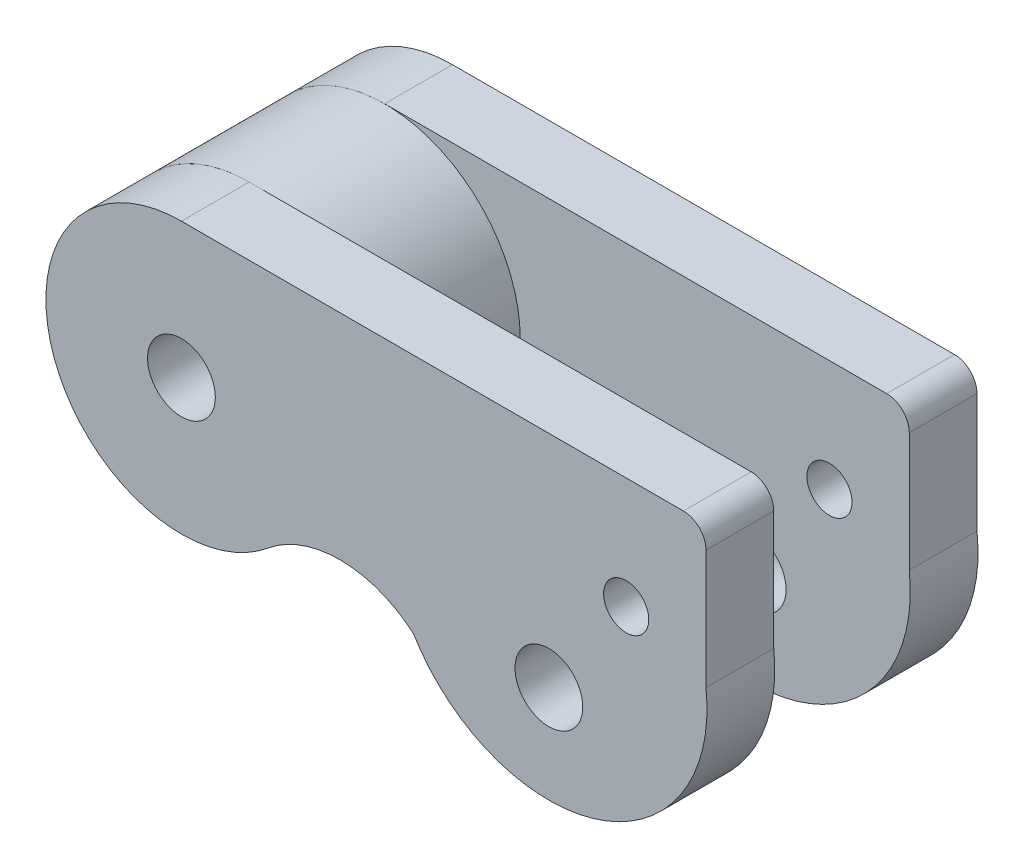
ISO-10303-21;
HEADER;
FILE_DESCRIPTION(('STEP AP214'),'2;1');
FILE_NAME('part.step','',(''),(''),'','','');
FILE_SCHEMA(('AUTOMOTIVE_DESIGN { 1 0 10303 214 1 1 1 1 }'));
ENDSEC;
DATA;
#1=APPLICATION_CONTEXT('core data for automotive mechanical design processes');
#2=APPLICATION_PROTOCOL_DEFINITION('international standard','automotive_design',2000,#1);
#3=PRODUCT_CONTEXT('',#1,'mechanical');
#4=PRODUCT('Part','Part','',(#3));
#5=PRODUCT_RELATED_PRODUCT_CATEGORY('part','',(#4));
#6=PRODUCT_DEFINITION_FORMATION('','',#4);
#7=PRODUCT_DEFINITION_CONTEXT('part definition',#1,'design');
#8=PRODUCT_DEFINITION('design','',#6,#7);
#9=PRODUCT_DEFINITION_SHAPE('','',#8);
#10=(LENGTH_UNIT() NAMED_UNIT(*) SI_UNIT(.MILLI.,.METRE.));
#11=(NAMED_UNIT(*) PLANE_ANGLE_UNIT() SI_UNIT($,.RADIAN.));
#12=(NAMED_UNIT(*) SI_UNIT($,.STERADIAN.) SOLID_ANGLE_UNIT());
#13=UNCERTAINTY_MEASURE_WITH_UNIT(LENGTH_MEASURE(1.E-05),#10,'distance_accuracy_value','');
#14=(GEOMETRIC_REPRESENTATION_CONTEXT(3) GLOBAL_UNCERTAINTY_ASSIGNED_CONTEXT((#13)) GLOBAL_UNIT_ASSIGNED_CONTEXT((#10,
#11,#12)) REPRESENTATION_CONTEXT('',''));
#15=CARTESIAN_POINT('',(0.,0.,0.));
#16=DIRECTION('',(0.,0.,1.));
#17=DIRECTION('',(1.,0.,0.));
#18=AXIS2_PLACEMENT_3D('',#15,#16,#17);
#19=CARTESIAN_POINT('',(-36.5079531845855,32.0877658669858,-7.88906792380567));
#20=DIRECTION('',(0.,0.,1.));
#21=DIRECTION('',(1.,0.,0.));
#22=AXIS2_PLACEMENT_3D('',#19,#20,#21);
#23=PLANE('',#22);
#24=CARTESIAN_POINT('',(-36.5079531845855,32.0877658669858,-7.88906792380567));
#25=DIRECTION('',(0.,0.,1.));
#26=DIRECTION('',(1.,0.,0.));
#27=AXIS2_PLACEMENT_3D('',#24,#25,#26);
#28=CIRCLE('',#27,6.);
#29=CARTESIAN_POINT('',(-30.5079531845855,32.0877658669858,-7.88906792380567));
#30=VERTEX_POINT('',#29);
#31=EDGE_CURVE('P0_E9',#30,#30,#28,.T.);
#32=ORIENTED_EDGE('',*,*,#31,.T.);
#33=EDGE_LOOP('',(#32));
#34=FACE_BOUND('',#33,.T.);
#35=CARTESIAN_POINT('',(-36.5079531845855,32.0877658669858,-7.88906792380567));
#36=DIRECTION('',(0.,0.,1.));
#37=DIRECTION('',(1.,0.,0.));
#38=AXIS2_PLACEMENT_3D('',#35,#36,#37);
#39=CIRCLE('',#38,1.5);
#40=CARTESIAN_POINT('',(-35.0079531845855,32.0877658669858,-7.88906792380567));
#41=VERTEX_POINT('',#40);
#42=EDGE_CURVE('P0_E25',#41,#41,#39,.T.);
#43=ORIENTED_EDGE('',*,*,#42,.F.);
#44=EDGE_LOOP('',(#43));
#45=FACE_BOUND('',#44,.T.);
#46=ADVANCED_FACE('P0_F14',(#34,#45),#23,.T.);
#47=CARTESIAN_POINT('',(-36.5079531845855,32.0877658669858,-13.8890679238057));
#48=DIRECTION('',(0.,0.,1.));
#49=DIRECTION('',(1.,0.,0.));
#50=AXIS2_PLACEMENT_3D('',#47,#48,#49);
#51=PLANE('',#50);
#52=CARTESIAN_POINT('',(-36.5079531845855,32.0877658669858,-13.8890679238057));
#53=DIRECTION('',(0.,0.,1.));
#54=DIRECTION('',(1.,0.,0.));
#55=AXIS2_PLACEMENT_3D('',#52,#53,#54);
#56=CIRCLE('',#55,6.);
#57=CARTESIAN_POINT('',(-30.5079531845855,32.0877658669858,-13.8890679238057));
#58=VERTEX_POINT('',#57);
#59=EDGE_CURVE('P0_E18',#58,#58,#56,.T.);
#60=ORIENTED_EDGE('',*,*,#59,.F.);
#61=EDGE_LOOP('',(#60));
#62=FACE_BOUND('',#61,.T.);
#63=CARTESIAN_POINT('',(-36.5079531845855,32.0877658669858,-13.8890679238057));
#64=DIRECTION('',(0.,0.,1.));
#65=DIRECTION('',(1.,0.,0.));
#66=AXIS2_PLACEMENT_3D('',#63,#64,#65);
#67=CIRCLE('',#66,1.5);
#68=CARTESIAN_POINT('',(-35.0079531845855,32.0877658669858,-13.8890679238057));
#69=VERTEX_POINT('',#68);
#70=EDGE_CURVE('P0_E27',#69,#69,#67,.T.);
#71=ORIENTED_EDGE('',*,*,#70,.T.);
#72=EDGE_LOOP('',(#71));
#73=FACE_BOUND('',#72,.T.);
#74=ADVANCED_FACE('P0_F37',(#62,#73),#51,.F.);
#75=CARTESIAN_POINT('',(-36.5079531845855,32.0877658669858,-7.88906792380567));
#76=DIRECTION('',(0.,0.,-1.));
#77=DIRECTION('',(-1.,0.,0.));
#78=AXIS2_PLACEMENT_3D('',#75,#76,#77);
#79=CYLINDRICAL_SURFACE('',#78,6.);
#80=ORIENTED_EDGE('',*,*,#31,.F.);
#81=EDGE_LOOP('',(#80));
#82=FACE_BOUND('',#81,.T.);
#83=ORIENTED_EDGE('',*,*,#59,.T.);
#84=EDGE_LOOP('',(#83));
#85=FACE_BOUND('',#84,.T.);
#86=ADVANCED_FACE('P0_F16',(#82,#85),#79,.T.);
#87=CARTESIAN_POINT('',(-36.5079531845855,32.0877658669858,-7.88906792380567));
#88=DIRECTION('',(0.,0.,-1.));
#89=DIRECTION('',(-1.,0.,0.));
#90=AXIS2_PLACEMENT_3D('',#87,#88,#89);
#91=CYLINDRICAL_SURFACE('',#90,1.5);
#92=ORIENTED_EDGE('',*,*,#42,.T.);
#93=EDGE_LOOP('',(#92));
#94=FACE_BOUND('',#93,.T.);
#95=ORIENTED_EDGE('',*,*,#70,.F.);
#96=EDGE_LOOP('',(#95));
#97=FACE_BOUND('',#96,.T.);
#98=ADVANCED_FACE('P0_F33',(#94,#97),#91,.F.);
#99=CLOSED_SHELL('',(#46,#74,#86,#98));
#100=MANIFOLD_SOLID_BREP('P0_B1',#99);
#101=CARTESIAN_POINT('',(-36.5079531845855,32.0877658669858,-13.8890679238057));
#102=DIRECTION('',(0.,0.,1.));
#103=DIRECTION('',(1.,0.,0.));
#104=AXIS2_PLACEMENT_3D('',#101,#102,#103);
#105=PLANE('',#104);
#106=CARTESIAN_POINT('',(-16.8173073685868,33.1516035289232,-13.8890679238057));
#107=DIRECTION('',(0.,0.,1.));
#108=DIRECTION('',(1.,0.,0.));
#109=AXIS2_PLACEMENT_3D('',#106,#107,#108);
#110=CIRCLE('',#109,0.999999999999994);
#111=CARTESIAN_POINT('',(-15.8173073685868,33.1516035289232,-13.8890679238057));
#112=VERTEX_POINT('',#111);
#113=EDGE_CURVE('P1_E134',#112,#112,#110,.T.);
#114=ORIENTED_EDGE('',*,*,#113,.F.);
#115=EDGE_LOOP('',(#114));
#116=FACE_BOUND('',#115,.T.);
#117=CARTESIAN_POINT('',(-36.5079531845855,32.0877658669858,-13.8890679238057));
#118=DIRECTION('',(0.,0.,1.));
#119=DIRECTION('',(1.,0.,0.));
#120=AXIS2_PLACEMENT_3D('',#117,#118,#119);
#121=CIRCLE('',#120,6.);
#122=CARTESIAN_POINT('',(-36.5079531845855,38.0877658669858,-13.8890679238057));
#123=VERTEX_POINT('',#122);
#124=CARTESIAN_POINT('',(-32.6806809274844,27.4669448284663,-13.8890679238057));
#125=VERTEX_POINT('',#124);
#126=EDGE_CURVE('P1_E115',#123,#125,#121,.T.);
#127=ORIENTED_EDGE('',*,*,#126,.T.);
#128=CARTESIAN_POINT('',(-29.4912873799001,23.6162606297001,-13.8890679238057));
#129=DIRECTION('',(0.,0.,-1.));
#130=DIRECTION('',(-1.,0.,0.));
#131=AXIS2_PLACEMENT_3D('',#128,#129,#130);
#132=CIRCLE('',#131,5.);
#133=CARTESIAN_POINT('',(-26.2387237848225,27.4137374314693,-13.8890679238057));
#134=VERTEX_POINT('',#133);
#135=EDGE_CURVE('P1_E69',#125,#134,#132,.T.);
#136=ORIENTED_EDGE('',*,*,#135,.T.);
#137=CARTESIAN_POINT('',(-20.2391904133696,31.0200651099843,-13.8890679238057));
#138=DIRECTION('',(0.,0.,1.));
#139=DIRECTION('',(1.,0.,0.));
#140=AXIS2_PLACEMENT_3D('',#137,#138,#139);
#141=CIRCLE('',#140,7.);
#142=CARTESIAN_POINT('',(-13.2845650790435,31.8157952521489,-13.8890679238057));
#143=VERTEX_POINT('',#142);
#144=EDGE_CURVE('P1_E83',#134,#143,#141,.T.);
#145=ORIENTED_EDGE('',*,*,#144,.T.);
#146=DIRECTION('',(0.,1.,0.));
#147=VECTOR('',#146,1.);
#148=CARTESIAN_POINT('',(-13.2845650790435,31.8157952521489,-13.8890679238057));
#149=LINE('',#148,#147);
#150=CARTESIAN_POINT('',(-13.2845650790435,37.0877658669858,-13.8890679238057));
#151=VERTEX_POINT('',#150);
#152=EDGE_CURVE('P1_E76',#143,#151,#149,.T.);
#153=ORIENTED_EDGE('',*,*,#152,.T.);
#154=CARTESIAN_POINT('',(-14.2845650790435,37.0877658669858,-13.8890679238057));
#155=DIRECTION('',(0.,0.,1.));
#156=DIRECTION('',(1.,0.,0.));
#157=AXIS2_PLACEMENT_3D('',#154,#155,#156);
#158=CIRCLE('',#157,1.);
#159=CARTESIAN_POINT('',(-14.2845650790435,38.0877658669858,-13.8890679238057));
#160=VERTEX_POINT('',#159);
#161=EDGE_CURVE('P1_E80',#151,#160,#158,.T.);
#162=ORIENTED_EDGE('',*,*,#161,.T.);
#163=DIRECTION('',(-1.,0.,0.));
#164=VECTOR('',#163,1.);
#165=CARTESIAN_POINT('',(-14.5079531845855,38.0877658669858,-13.8890679238057));
#166=LINE('',#165,#164);
#167=EDGE_CURVE('P1_E34',#160,#123,#166,.T.);
#168=ORIENTED_EDGE('',*,*,#167,.T.);
#169=EDGE_LOOP('',(#127,#136,#145,#153,#162,#168));
#170=FACE_BOUND('',#169,.T.);
#171=CARTESIAN_POINT('',(-36.5079531845855,32.0877658669858,-13.8890679238057));
#172=DIRECTION('',(0.,0.,1.));
#173=DIRECTION('',(1.,0.,0.));
#174=AXIS2_PLACEMENT_3D('',#171,#172,#173);
#175=CIRCLE('',#174,1.5);
#176=CARTESIAN_POINT('',(-35.0079531845855,32.0877658669858,-13.8890679238057));
#177=VERTEX_POINT('',#176);
#178=EDGE_CURVE('P1_E107',#177,#177,#175,.T.);
#179=ORIENTED_EDGE('',*,*,#178,.F.);
#180=EDGE_LOOP('',(#179));
#181=FACE_BOUND('',#180,.T.);
#182=CARTESIAN_POINT('',(-20.2391904133696,28.33979962794,-13.8890679238057));
#183=DIRECTION('',(0.,0.,1.));
#184=DIRECTION('',(1.,0.,0.));
#185=AXIS2_PLACEMENT_3D('',#182,#183,#184);
#186=CIRCLE('',#185,1.5);
#187=CARTESIAN_POINT('',(-18.7391904133696,28.33979962794,-13.8890679238057));
#188=VERTEX_POINT('',#187);
#189=EDGE_CURVE('P1_E140',#188,#188,#186,.T.);
#190=ORIENTED_EDGE('',*,*,#189,.F.);
#191=EDGE_LOOP('',(#190));
#192=FACE_BOUND('',#191,.T.);
#193=ADVANCED_FACE('P1_F17',(#116,#170,#181,#192),#105,.T.);
#194=CARTESIAN_POINT('',(-36.5079531845855,32.0877658669858,-16.8890679238057));
#195=DIRECTION('',(0.,0.,1.));
#196=DIRECTION('',(1.,0.,0.));
#197=AXIS2_PLACEMENT_3D('',#194,#195,#196);
#198=PLANE('',#197);
#199=CARTESIAN_POINT('',(-36.5079531845855,32.0877658669858,-16.8890679238057));
#200=DIRECTION('',(0.,0.,1.));
#201=DIRECTION('',(1.,0.,0.));
#202=AXIS2_PLACEMENT_3D('',#199,#200,#201);
#203=CIRCLE('',#202,6.);
#204=CARTESIAN_POINT('',(-36.5079531845855,38.0877658669858,-16.8890679238057));
#205=VERTEX_POINT('',#204);
#206=CARTESIAN_POINT('',(-32.6806809274844,27.4669448284663,-16.8890679238057));
#207=VERTEX_POINT('',#206);
#208=EDGE_CURVE('P1_E103',#205,#207,#203,.T.);
#209=ORIENTED_EDGE('',*,*,#208,.F.);
#210=DIRECTION('',(-1.,0.,0.));
#211=VECTOR('',#210,1.);
#212=CARTESIAN_POINT('',(-36.5079531845855,38.0877658669858,-16.8890679238057));
#213=LINE('',#212,#211);
#214=CARTESIAN_POINT('',(-14.2845650790435,38.0877658669858,-16.8890679238057));
#215=VERTEX_POINT('',#214);
#216=EDGE_CURVE('P1_E57',#215,#205,#213,.T.);
#217=ORIENTED_EDGE('',*,*,#216,.F.);
#218=CARTESIAN_POINT('',(-14.2845650790435,37.0877658669858,-16.8890679238057));
#219=DIRECTION('',(0.,0.,1.));
#220=DIRECTION('',(1.,0.,0.));
#221=AXIS2_PLACEMENT_3D('',#218,#219,#220);
#222=CIRCLE('',#221,1.);
#223=CARTESIAN_POINT('',(-13.2845650790435,37.0877658669858,-16.8890679238057));
#224=VERTEX_POINT('',#223);
#225=EDGE_CURVE('P1_E112',#224,#215,#222,.T.);
#226=ORIENTED_EDGE('',*,*,#225,.F.);
#227=DIRECTION('',(0.,1.,0.));
#228=VECTOR('',#227,1.);
#229=CARTESIAN_POINT('',(-13.2845650790435,31.8157952521489,-16.8890679238057));
#230=LINE('',#229,#228);
#231=CARTESIAN_POINT('',(-13.2845650790435,31.8157952521489,-16.8890679238057));
#232=VERTEX_POINT('',#231);
#233=EDGE_CURVE('P1_E92',#232,#224,#230,.T.);
#234=ORIENTED_EDGE('',*,*,#233,.F.);
#235=CARTESIAN_POINT('',(-20.2391904133696,31.0200651099843,-16.8890679238057));
#236=DIRECTION('',(0.,0.,1.));
#237=DIRECTION('',(1.,0.,0.));
#238=AXIS2_PLACEMENT_3D('',#235,#236,#237);
#239=CIRCLE('',#238,7.);
#240=CARTESIAN_POINT('',(-26.2387237848225,27.4137374314693,-16.8890679238057));
#241=VERTEX_POINT('',#240);
#242=EDGE_CURVE('P1_E109',#241,#232,#239,.T.);
#243=ORIENTED_EDGE('',*,*,#242,.F.);
#244=CARTESIAN_POINT('',(-29.4912873799001,23.6162606297001,-16.8890679238057));
#245=DIRECTION('',(0.,0.,-1.));
#246=DIRECTION('',(-1.,0.,0.));
#247=AXIS2_PLACEMENT_3D('',#244,#245,#246);
#248=CIRCLE('',#247,5.);
#249=EDGE_CURVE('P1_E106',#207,#241,#248,.T.);
#250=ORIENTED_EDGE('',*,*,#249,.F.);
#251=EDGE_LOOP('',(#209,#217,#226,#234,#243,#250));
#252=FACE_BOUND('',#251,.T.);
#253=CARTESIAN_POINT('',(-36.5079531845855,32.0877658669858,-16.8890679238057));
#254=DIRECTION('',(0.,0.,1.));
#255=DIRECTION('',(1.,0.,0.));
#256=AXIS2_PLACEMENT_3D('',#253,#254,#255);
#257=CIRCLE('',#256,1.5);
#258=CARTESIAN_POINT('',(-35.0079531845855,32.0877658669858,-16.8890679238057));
#259=VERTEX_POINT('',#258);
#260=EDGE_CURVE('P1_E131',#259,#259,#257,.T.);
#261=ORIENTED_EDGE('',*,*,#260,.T.);
#262=EDGE_LOOP('',(#261));
#263=FACE_BOUND('',#262,.T.);
#264=CARTESIAN_POINT('',(-16.8173073685868,33.1516035289232,-16.8890679238057));
#265=DIRECTION('',(0.,0.,1.));
#266=DIRECTION('',(1.,0.,0.));
#267=AXIS2_PLACEMENT_3D('',#264,#265,#266);
#268=CIRCLE('',#267,0.999999999999994);
#269=CARTESIAN_POINT('',(-15.8173073685868,33.1516035289232,-16.8890679238057));
#270=VERTEX_POINT('',#269);
#271=EDGE_CURVE('P1_E137',#270,#270,#268,.T.);
#272=ORIENTED_EDGE('',*,*,#271,.T.);
#273=EDGE_LOOP('',(#272));
#274=FACE_BOUND('',#273,.T.);
#275=CARTESIAN_POINT('',(-20.2391904133696,28.33979962794,-16.8890679238057));
#276=DIRECTION('',(0.,0.,1.));
#277=DIRECTION('',(1.,0.,0.));
#278=AXIS2_PLACEMENT_3D('',#275,#276,#277);
#279=CIRCLE('',#278,1.5);
#280=CARTESIAN_POINT('',(-18.7391904133696,28.33979962794,-16.8890679238057));
#281=VERTEX_POINT('',#280);
#282=EDGE_CURVE('P1_E143',#281,#281,#279,.T.);
#283=ORIENTED_EDGE('',*,*,#282,.T.);
#284=EDGE_LOOP('',(#283));
#285=FACE_BOUND('',#284,.T.);
#286=ADVANCED_FACE('P1_F122',(#252,#263,#274,#285),#198,.F.);
#287=CARTESIAN_POINT('',(-36.5079531845855,32.0877658669858,-13.8890679238057));
#288=DIRECTION('',(0.,0.,-1.));
#289=DIRECTION('',(-1.,0.,0.));
#290=AXIS2_PLACEMENT_3D('',#287,#288,#289);
#291=CYLINDRICAL_SURFACE('',#290,6.);
#292=ORIENTED_EDGE('',*,*,#208,.T.);
#293=DIRECTION('',(0.,0.,-1.));
#294=VECTOR('',#293,1.);
#295=CARTESIAN_POINT('',(-32.6806809274844,27.4669448284663,-13.8890679238057));
#296=LINE('',#295,#294);
#297=EDGE_CURVE('P1_E11',#125,#207,#296,.T.);
#298=ORIENTED_EDGE('',*,*,#297,.F.);
#299=ORIENTED_EDGE('',*,*,#126,.F.);
#300=DIRECTION('',(0.,0.,-1.));
#301=VECTOR('',#300,1.);
#302=CARTESIAN_POINT('',(-36.5079531845855,38.0877658669858,-13.8890679238057));
#303=LINE('',#302,#301);
#304=EDGE_CURVE('P1_E99',#123,#205,#303,.T.);
#305=ORIENTED_EDGE('',*,*,#304,.T.);
#306=EDGE_LOOP('',(#292,#298,#299,#305));
#307=FACE_BOUND('',#306,.T.);
#308=ADVANCED_FACE('P1_F19',(#307),#291,.T.);
#309=CARTESIAN_POINT('',(-29.4912873799001,23.6162606297001,-13.8890679238057));
#310=DIRECTION('',(0.,0.,-1.));
#311=DIRECTION('',(-1.,0.,0.));
#312=AXIS2_PLACEMENT_3D('',#309,#310,#311);
#313=CYLINDRICAL_SURFACE('',#312,5.);
#314=ORIENTED_EDGE('',*,*,#249,.T.);
#315=DIRECTION('',(0.,0.,-1.));
#316=VECTOR('',#315,1.);
#317=CARTESIAN_POINT('',(-26.2387237848225,27.4137374314693,-13.8890679238057));
#318=LINE('',#317,#316);
#319=EDGE_CURVE('P1_E26',#134,#241,#318,.T.);
#320=ORIENTED_EDGE('',*,*,#319,.F.);
#321=ORIENTED_EDGE('',*,*,#135,.F.);
#322=ORIENTED_EDGE('',*,*,#297,.T.);
#323=EDGE_LOOP('',(#314,#320,#321,#322));
#324=FACE_BOUND('',#323,.T.);
#325=ADVANCED_FACE('P1_F172',(#324),#313,.F.);
#326=CARTESIAN_POINT('',(-20.2391904133696,31.0200651099843,-13.8890679238057));
#327=DIRECTION('',(0.,0.,-1.));
#328=DIRECTION('',(-1.,0.,0.));
#329=AXIS2_PLACEMENT_3D('',#326,#327,#328);
#330=CYLINDRICAL_SURFACE('',#329,7.);
#331=ORIENTED_EDGE('',*,*,#242,.T.);
#332=DIRECTION('',(0.,0.,-1.));
#333=VECTOR('',#332,1.);
#334=CARTESIAN_POINT('',(-13.2845650790435,31.8157952521489,-13.8890679238057));
#335=LINE('',#334,#333);
#336=EDGE_CURVE('P1_E94',#143,#232,#335,.T.);
#337=ORIENTED_EDGE('',*,*,#336,.F.);
#338=ORIENTED_EDGE('',*,*,#144,.F.);
#339=ORIENTED_EDGE('',*,*,#319,.T.);
#340=EDGE_LOOP('',(#331,#337,#338,#339));
#341=FACE_BOUND('',#340,.T.);
#342=ADVANCED_FACE('P1_F121',(#341),#330,.T.);
#343=CARTESIAN_POINT('',(-13.2845650790435,31.8157952521489,-13.8890679238057));
#344=DIRECTION('',(-1.,0.,0.));
#345=DIRECTION('',(0.,0.,1.));
#346=AXIS2_PLACEMENT_3D('',#343,#344,#345);
#347=PLANE('',#346);
#348=ORIENTED_EDGE('',*,*,#233,.T.);
#349=DIRECTION('',(0.,0.,-1.));
#350=VECTOR('',#349,1.);
#351=CARTESIAN_POINT('',(-13.2845650790435,37.0877658669858,-13.8890679238057));
#352=LINE('',#351,#350);
#353=EDGE_CURVE('P1_E89',#151,#224,#352,.T.);
#354=ORIENTED_EDGE('',*,*,#353,.F.);
#355=ORIENTED_EDGE('',*,*,#152,.F.);
#356=ORIENTED_EDGE('',*,*,#336,.T.);
#357=EDGE_LOOP('',(#348,#354,#355,#356));
#358=FACE_BOUND('',#357,.T.);
#359=ADVANCED_FACE('P1_F90',(#358),#347,.F.);
#360=CARTESIAN_POINT('',(-14.2845650790435,37.0877658669858,-13.8890679238057));
#361=DIRECTION('',(0.,0.,-1.));
#362=DIRECTION('',(-1.,0.,0.));
#363=AXIS2_PLACEMENT_3D('',#360,#361,#362);
#364=CYLINDRICAL_SURFACE('',#363,1.);
#365=ORIENTED_EDGE('',*,*,#225,.T.);
#366=DIRECTION('',(0.,0.,-1.));
#367=VECTOR('',#366,1.);
#368=CARTESIAN_POINT('',(-14.2845650790435,38.0877658669858,-13.8890679238057));
#369=LINE('',#368,#367);
#370=EDGE_CURVE('P1_E95',#160,#215,#369,.T.);
#371=ORIENTED_EDGE('',*,*,#370,.F.);
#372=ORIENTED_EDGE('',*,*,#161,.F.);
#373=ORIENTED_EDGE('',*,*,#353,.T.);
#374=EDGE_LOOP('',(#365,#371,#372,#373));
#375=FACE_BOUND('',#374,.T.);
#376=ADVANCED_FACE('P1_F97',(#375),#364,.T.);
#377=CARTESIAN_POINT('',(-36.5079531845855,38.0877658669858,-13.8890679238057));
#378=DIRECTION('',(0.,-1.,0.));
#379=DIRECTION('',(0.,0.,-1.));
#380=AXIS2_PLACEMENT_3D('',#377,#378,#379);
#381=PLANE('',#380);
#382=ORIENTED_EDGE('',*,*,#216,.T.);
#383=ORIENTED_EDGE('',*,*,#304,.F.);
#384=ORIENTED_EDGE('',*,*,#167,.F.);
#385=ORIENTED_EDGE('',*,*,#370,.T.);
#386=EDGE_LOOP('',(#382,#383,#384,#385));
#387=FACE_BOUND('',#386,.T.);
#388=ADVANCED_FACE('P1_F124',(#387),#381,.F.);
#389=CARTESIAN_POINT('',(-36.5079531845855,32.0877658669858,-13.8890679238057));
#390=DIRECTION('',(0.,0.,-1.));
#391=DIRECTION('',(-1.,0.,0.));
#392=AXIS2_PLACEMENT_3D('',#389,#390,#391);
#393=CYLINDRICAL_SURFACE('',#392,1.5);
#394=ORIENTED_EDGE('',*,*,#178,.T.);
#395=EDGE_LOOP('',(#394));
#396=FACE_BOUND('',#395,.T.);
#397=ORIENTED_EDGE('',*,*,#260,.F.);
#398=EDGE_LOOP('',(#397));
#399=FACE_BOUND('',#398,.T.);
#400=ADVANCED_FACE('P1_F162',(#396,#399),#393,.F.);
#401=CARTESIAN_POINT('',(-16.8173073685868,33.1516035289232,-13.8890679238057));
#402=DIRECTION('',(0.,0.,-1.));
#403=DIRECTION('',(-1.,0.,0.));
#404=AXIS2_PLACEMENT_3D('',#401,#402,#403);
#405=CYLINDRICAL_SURFACE('',#404,0.999999999999994);
#406=ORIENTED_EDGE('',*,*,#113,.T.);
#407=EDGE_LOOP('',(#406));
#408=FACE_BOUND('',#407,.T.);
#409=ORIENTED_EDGE('',*,*,#271,.F.);
#410=EDGE_LOOP('',(#409));
#411=FACE_BOUND('',#410,.T.);
#412=ADVANCED_FACE('P1_F230',(#408,#411),#405,.F.);
#413=CARTESIAN_POINT('',(-20.2391904133696,28.33979962794,-13.8890679238057));
#414=DIRECTION('',(0.,0.,-1.));
#415=DIRECTION('',(-1.,0.,0.));
#416=AXIS2_PLACEMENT_3D('',#413,#414,#415);
#417=CYLINDRICAL_SURFACE('',#416,1.5);
#418=ORIENTED_EDGE('',*,*,#189,.T.);
#419=EDGE_LOOP('',(#418));
#420=FACE_BOUND('',#419,.T.);
#421=ORIENTED_EDGE('',*,*,#282,.F.);
#422=EDGE_LOOP('',(#421));
#423=FACE_BOUND('',#422,.T.);
#424=ADVANCED_FACE('P1_F149',(#420,#423),#417,.F.);
#425=CLOSED_SHELL('',(#193,#286,#308,#325,#342,#359,#376,#388,#400,#412,#424));
#426=MANIFOLD_SOLID_BREP('P1_B1',#425);
#427=CARTESIAN_POINT('',(-36.5079531845855,32.0877658669858,-4.88906792380567));
#428=DIRECTION('',(0.,0.,1.));
#429=DIRECTION('',(1.,0.,0.));
#430=AXIS2_PLACEMENT_3D('',#427,#428,#429);
#431=PLANE('',#430);
#432=CARTESIAN_POINT('',(-16.8173073685868,33.1516035289232,-4.88906792380567));
#433=DIRECTION('',(0.,0.,1.));
#434=DIRECTION('',(1.,0.,0.));
#435=AXIS2_PLACEMENT_3D('',#432,#433,#434);
#436=CIRCLE('',#435,0.999999999999994);
#437=CARTESIAN_POINT('',(-15.8173073685868,33.1516035289232,-4.88906792380567));
#438=VERTEX_POINT('',#437);
#439=EDGE_CURVE('P2_E134',#438,#438,#436,.T.);
#440=ORIENTED_EDGE('',*,*,#439,.F.);
#441=EDGE_LOOP('',(#440));
#442=FACE_BOUND('',#441,.T.);
#443=CARTESIAN_POINT('',(-36.5079531845855,32.0877658669858,-4.88906792380567));
#444=DIRECTION('',(0.,0.,1.));
#445=DIRECTION('',(1.,0.,0.));
#446=AXIS2_PLACEMENT_3D('',#443,#444,#445);
#447=CIRCLE('',#446,6.);
#448=CARTESIAN_POINT('',(-36.5079531845855,38.0877658669858,-4.88906792380567));
#449=VERTEX_POINT('',#448);
#450=CARTESIAN_POINT('',(-32.6806809274844,27.4669448284663,-4.88906792380567));
#451=VERTEX_POINT('',#450);
#452=EDGE_CURVE('P2_E115',#449,#451,#447,.T.);
#453=ORIENTED_EDGE('',*,*,#452,.T.);
#454=CARTESIAN_POINT('',(-29.4912873799001,23.6162606297001,-4.88906792380567));
#455=DIRECTION('',(0.,0.,-1.));
#456=DIRECTION('',(-1.,0.,0.));
#457=AXIS2_PLACEMENT_3D('',#454,#455,#456);
#458=CIRCLE('',#457,5.);
#459=CARTESIAN_POINT('',(-26.2387237848225,27.4137374314693,-4.88906792380567));
#460=VERTEX_POINT('',#459);
#461=EDGE_CURVE('P2_E69',#451,#460,#458,.T.);
#462=ORIENTED_EDGE('',*,*,#461,.T.);
#463=CARTESIAN_POINT('',(-20.2391904133696,31.0200651099843,-4.88906792380567));
#464=DIRECTION('',(0.,0.,1.));
#465=DIRECTION('',(1.,0.,0.));
#466=AXIS2_PLACEMENT_3D('',#463,#464,#465);
#467=CIRCLE('',#466,7.);
#468=CARTESIAN_POINT('',(-13.2845650790435,31.8157952521489,-4.88906792380567));
#469=VERTEX_POINT('',#468);
#470=EDGE_CURVE('P2_E83',#460,#469,#467,.T.);
#471=ORIENTED_EDGE('',*,*,#470,.T.);
#472=DIRECTION('',(0.,1.,0.));
#473=VECTOR('',#472,1.);
#474=CARTESIAN_POINT('',(-13.2845650790435,31.8157952521489,-4.88906792380567));
#475=LINE('',#474,#473);
#476=CARTESIAN_POINT('',(-13.2845650790435,37.0877658669858,-4.88906792380567));
#477=VERTEX_POINT('',#476);
#478=EDGE_CURVE('P2_E76',#469,#477,#475,.T.);
#479=ORIENTED_EDGE('',*,*,#478,.T.);
#480=CARTESIAN_POINT('',(-14.2845650790435,37.0877658669858,-4.88906792380567));
#481=DIRECTION('',(0.,0.,1.));
#482=DIRECTION('',(1.,0.,0.));
#483=AXIS2_PLACEMENT_3D('',#480,#481,#482);
#484=CIRCLE('',#483,1.);
#485=CARTESIAN_POINT('',(-14.2845650790435,38.0877658669858,-4.88906792380567));
#486=VERTEX_POINT('',#485);
#487=EDGE_CURVE('P2_E80',#477,#486,#484,.T.);
#488=ORIENTED_EDGE('',*,*,#487,.T.);
#489=DIRECTION('',(-1.,0.,0.));
#490=VECTOR('',#489,1.);
#491=CARTESIAN_POINT('',(-14.5079531845855,38.0877658669858,-4.88906792380567));
#492=LINE('',#491,#490);
#493=EDGE_CURVE('P2_E34',#486,#449,#492,.T.);
#494=ORIENTED_EDGE('',*,*,#493,.T.);
#495=EDGE_LOOP('',(#453,#462,#471,#479,#488,#494));
#496=FACE_BOUND('',#495,.T.);
#497=CARTESIAN_POINT('',(-36.5079531845855,32.0877658669858,-4.88906792380567));
#498=DIRECTION('',(0.,0.,1.));
#499=DIRECTION('',(1.,0.,0.));
#500=AXIS2_PLACEMENT_3D('',#497,#498,#499);
#501=CIRCLE('',#500,1.5);
#502=CARTESIAN_POINT('',(-35.0079531845855,32.0877658669858,-4.88906792380567));
#503=VERTEX_POINT('',#502);
#504=EDGE_CURVE('P2_E107',#503,#503,#501,.T.);
#505=ORIENTED_EDGE('',*,*,#504,.F.);
#506=EDGE_LOOP('',(#505));
#507=FACE_BOUND('',#506,.T.);
#508=CARTESIAN_POINT('',(-20.2391904133696,28.33979962794,-4.88906792380567));
#509=DIRECTION('',(0.,0.,1.));
#510=DIRECTION('',(1.,0.,0.));
#511=AXIS2_PLACEMENT_3D('',#508,#509,#510);
#512=CIRCLE('',#511,1.5);
#513=CARTESIAN_POINT('',(-18.7391904133696,28.33979962794,-4.88906792380567));
#514=VERTEX_POINT('',#513);
#515=EDGE_CURVE('P2_E140',#514,#514,#512,.T.);
#516=ORIENTED_EDGE('',*,*,#515,.F.);
#517=EDGE_LOOP('',(#516));
#518=FACE_BOUND('',#517,.T.);
#519=ADVANCED_FACE('P2_F17',(#442,#496,#507,#518),#431,.T.);
#520=CARTESIAN_POINT('',(-36.5079531845855,32.0877658669858,-7.88906792380567));
#521=DIRECTION('',(0.,0.,1.));
#522=DIRECTION('',(1.,0.,0.));
#523=AXIS2_PLACEMENT_3D('',#520,#521,#522);
#524=PLANE('',#523);
#525=CARTESIAN_POINT('',(-36.5079531845855,32.0877658669858,-7.88906792380567));
#526=DIRECTION('',(0.,0.,1.));
#527=DIRECTION('',(1.,0.,0.));
#528=AXIS2_PLACEMENT_3D('',#525,#526,#527);
#529=CIRCLE('',#528,6.);
#530=CARTESIAN_POINT('',(-36.5079531845855,38.0877658669858,-7.88906792380567));
#531=VERTEX_POINT('',#530);
#532=CARTESIAN_POINT('',(-32.6806809274844,27.4669448284663,-7.88906792380567));
#533=VERTEX_POINT('',#532);
#534=EDGE_CURVE('P2_E103',#531,#533,#529,.T.);
#535=ORIENTED_EDGE('',*,*,#534,.F.);
#536=DIRECTION('',(-1.,0.,0.));
#537=VECTOR('',#536,1.);
#538=CARTESIAN_POINT('',(-36.5079531845855,38.0877658669858,-7.88906792380567));
#539=LINE('',#538,#537);
#540=CARTESIAN_POINT('',(-14.2845650790435,38.0877658669858,-7.88906792380567));
#541=VERTEX_POINT('',#540);
#542=EDGE_CURVE('P2_E57',#541,#531,#539,.T.);
#543=ORIENTED_EDGE('',*,*,#542,.F.);
#544=CARTESIAN_POINT('',(-14.2845650790435,37.0877658669858,-7.88906792380567));
#545=DIRECTION('',(0.,0.,1.));
#546=DIRECTION('',(1.,0.,0.));
#547=AXIS2_PLACEMENT_3D('',#544,#545,#546);
#548=CIRCLE('',#547,1.);
#549=CARTESIAN_POINT('',(-13.2845650790435,37.0877658669858,-7.88906792380567));
#550=VERTEX_POINT('',#549);
#551=EDGE_CURVE('P2_E112',#550,#541,#548,.T.);
#552=ORIENTED_EDGE('',*,*,#551,.F.);
#553=DIRECTION('',(0.,1.,0.));
#554=VECTOR('',#553,1.);
#555=CARTESIAN_POINT('',(-13.2845650790435,31.8157952521489,-7.88906792380567));
#556=LINE('',#555,#554);
#557=CARTESIAN_POINT('',(-13.2845650790435,31.8157952521489,-7.88906792380567));
#558=VERTEX_POINT('',#557);
#559=EDGE_CURVE('P2_E92',#558,#550,#556,.T.);
#560=ORIENTED_EDGE('',*,*,#559,.F.);
#561=CARTESIAN_POINT('',(-20.2391904133696,31.0200651099843,-7.88906792380567));
#562=DIRECTION('',(0.,0.,1.));
#563=DIRECTION('',(1.,0.,0.));
#564=AXIS2_PLACEMENT_3D('',#561,#562,#563);
#565=CIRCLE('',#564,7.);
#566=CARTESIAN_POINT('',(-26.2387237848225,27.4137374314693,-7.88906792380567));
#567=VERTEX_POINT('',#566);
#568=EDGE_CURVE('P2_E109',#567,#558,#565,.T.);
#569=ORIENTED_EDGE('',*,*,#568,.F.);
#570=CARTESIAN_POINT('',(-29.4912873799001,23.6162606297001,-7.88906792380567));
#571=DIRECTION('',(0.,0.,-1.));
#572=DIRECTION('',(-1.,0.,0.));
#573=AXIS2_PLACEMENT_3D('',#570,#571,#572);
#574=CIRCLE('',#573,5.);
#575=EDGE_CURVE('P2_E106',#533,#567,#574,.T.);
#576=ORIENTED_EDGE('',*,*,#575,.F.);
#577=EDGE_LOOP('',(#535,#543,#552,#560,#569,#576));
#578=FACE_BOUND('',#577,.T.);
#579=CARTESIAN_POINT('',(-36.5079531845855,32.0877658669858,-7.88906792380567));
#580=DIRECTION('',(0.,0.,1.));
#581=DIRECTION('',(1.,0.,0.));
#582=AXIS2_PLACEMENT_3D('',#579,#580,#581);
#583=CIRCLE('',#582,1.5);
#584=CARTESIAN_POINT('',(-35.0079531845855,32.0877658669858,-7.88906792380567));
#585=VERTEX_POINT('',#584);
#586=EDGE_CURVE('P2_E131',#585,#585,#583,.T.);
#587=ORIENTED_EDGE('',*,*,#586,.T.);
#588=EDGE_LOOP('',(#587));
#589=FACE_BOUND('',#588,.T.);
#590=CARTESIAN_POINT('',(-16.8173073685868,33.1516035289232,-7.88906792380567));
#591=DIRECTION('',(0.,0.,1.));
#592=DIRECTION('',(1.,0.,0.));
#593=AXIS2_PLACEMENT_3D('',#590,#591,#592);
#594=CIRCLE('',#593,0.999999999999994);
#595=CARTESIAN_POINT('',(-15.8173073685868,33.1516035289232,-7.88906792380567));
#596=VERTEX_POINT('',#595);
#597=EDGE_CURVE('P2_E137',#596,#596,#594,.T.);
#598=ORIENTED_EDGE('',*,*,#597,.T.);
#599=EDGE_LOOP('',(#598));
#600=FACE_BOUND('',#599,.T.);
#601=CARTESIAN_POINT('',(-20.2391904133696,28.33979962794,-7.88906792380567));
#602=DIRECTION('',(0.,0.,1.));
#603=DIRECTION('',(1.,0.,0.));
#604=AXIS2_PLACEMENT_3D('',#601,#602,#603);
#605=CIRCLE('',#604,1.5);
#606=CARTESIAN_POINT('',(-18.7391904133696,28.33979962794,-7.88906792380567));
#607=VERTEX_POINT('',#606);
#608=EDGE_CURVE('P2_E143',#607,#607,#605,.T.);
#609=ORIENTED_EDGE('',*,*,#608,.T.);
#610=EDGE_LOOP('',(#609));
#611=FACE_BOUND('',#610,.T.);
#612=ADVANCED_FACE('P2_F122',(#578,#589,#600,#611),#524,.F.);
#613=CARTESIAN_POINT('',(-36.5079531845855,32.0877658669858,-4.88906792380567));
#614=DIRECTION('',(0.,0.,-1.));
#615=DIRECTION('',(-1.,0.,0.));
#616=AXIS2_PLACEMENT_3D('',#613,#614,#615);
#617=CYLINDRICAL_SURFACE('',#616,6.);
#618=ORIENTED_EDGE('',*,*,#534,.T.);
#619=DIRECTION('',(0.,0.,-1.));
#620=VECTOR('',#619,1.);
#621=CARTESIAN_POINT('',(-32.6806809274844,27.4669448284663,-4.88906792380567));
#622=LINE('',#621,#620);
#623=EDGE_CURVE('P2_E11',#451,#533,#622,.T.);
#624=ORIENTED_EDGE('',*,*,#623,.F.);
#625=ORIENTED_EDGE('',*,*,#452,.F.);
#626=DIRECTION('',(0.,0.,-1.));
#627=VECTOR('',#626,1.);
#628=CARTESIAN_POINT('',(-36.5079531845855,38.0877658669858,-4.88906792380567));
#629=LINE('',#628,#627);
#630=EDGE_CURVE('P2_E99',#449,#531,#629,.T.);
#631=ORIENTED_EDGE('',*,*,#630,.T.);
#632=EDGE_LOOP('',(#618,#624,#625,#631));
#633=FACE_BOUND('',#632,.T.);
#634=ADVANCED_FACE('P2_F19',(#633),#617,.T.);
#635=CARTESIAN_POINT('',(-29.4912873799001,23.6162606297001,-4.88906792380567));
#636=DIRECTION('',(0.,0.,-1.));
#637=DIRECTION('',(-1.,0.,0.));
#638=AXIS2_PLACEMENT_3D('',#635,#636,#637);
#639=CYLINDRICAL_SURFACE('',#638,5.);
#640=ORIENTED_EDGE('',*,*,#575,.T.);
#641=DIRECTION('',(0.,0.,-1.));
#642=VECTOR('',#641,1.);
#643=CARTESIAN_POINT('',(-26.2387237848225,27.4137374314693,-4.88906792380567));
#644=LINE('',#643,#642);
#645=EDGE_CURVE('P2_E26',#460,#567,#644,.T.);
#646=ORIENTED_EDGE('',*,*,#645,.F.);
#647=ORIENTED_EDGE('',*,*,#461,.F.);
#648=ORIENTED_EDGE('',*,*,#623,.T.);
#649=EDGE_LOOP('',(#640,#646,#647,#648));
#650=FACE_BOUND('',#649,.T.);
#651=ADVANCED_FACE('P2_F172',(#650),#639,.F.);
#652=CARTESIAN_POINT('',(-20.2391904133696,31.0200651099843,-4.88906792380567));
#653=DIRECTION('',(0.,0.,-1.));
#654=DIRECTION('',(-1.,0.,0.));
#655=AXIS2_PLACEMENT_3D('',#652,#653,#654);
#656=CYLINDRICAL_SURFACE('',#655,7.);
#657=ORIENTED_EDGE('',*,*,#568,.T.);
#658=DIRECTION('',(0.,0.,-1.));
#659=VECTOR('',#658,1.);
#660=CARTESIAN_POINT('',(-13.2845650790435,31.8157952521489,-4.88906792380567));
#661=LINE('',#660,#659);
#662=EDGE_CURVE('P2_E94',#469,#558,#661,.T.);
#663=ORIENTED_EDGE('',*,*,#662,.F.);
#664=ORIENTED_EDGE('',*,*,#470,.F.);
#665=ORIENTED_EDGE('',*,*,#645,.T.);
#666=EDGE_LOOP('',(#657,#663,#664,#665));
#667=FACE_BOUND('',#666,.T.);
#668=ADVANCED_FACE('P2_F121',(#667),#656,.T.);
#669=CARTESIAN_POINT('',(-13.2845650790435,31.8157952521489,-4.88906792380567));
#670=DIRECTION('',(-1.,0.,0.));
#671=DIRECTION('',(0.,0.,1.));
#672=AXIS2_PLACEMENT_3D('',#669,#670,#671);
#673=PLANE('',#672);
#674=ORIENTED_EDGE('',*,*,#559,.T.);
#675=DIRECTION('',(0.,0.,-1.));
#676=VECTOR('',#675,1.);
#677=CARTESIAN_POINT('',(-13.2845650790435,37.0877658669858,-4.88906792380567));
#678=LINE('',#677,#676);
#679=EDGE_CURVE('P2_E89',#477,#550,#678,.T.);
#680=ORIENTED_EDGE('',*,*,#679,.F.);
#681=ORIENTED_EDGE('',*,*,#478,.F.);
#682=ORIENTED_EDGE('',*,*,#662,.T.);
#683=EDGE_LOOP('',(#674,#680,#681,#682));
#684=FACE_BOUND('',#683,.T.);
#685=ADVANCED_FACE('P2_F90',(#684),#673,.F.);
#686=CARTESIAN_POINT('',(-14.2845650790435,37.0877658669858,-4.88906792380567));
#687=DIRECTION('',(0.,0.,-1.));
#688=DIRECTION('',(-1.,0.,0.));
#689=AXIS2_PLACEMENT_3D('',#686,#687,#688);
#690=CYLINDRICAL_SURFACE('',#689,1.);
#691=ORIENTED_EDGE('',*,*,#551,.T.);
#692=DIRECTION('',(0.,0.,-1.));
#693=VECTOR('',#692,1.);
#694=CARTESIAN_POINT('',(-14.2845650790435,38.0877658669858,-4.88906792380567));
#695=LINE('',#694,#693);
#696=EDGE_CURVE('P2_E95',#486,#541,#695,.T.);
#697=ORIENTED_EDGE('',*,*,#696,.F.);
#698=ORIENTED_EDGE('',*,*,#487,.F.);
#699=ORIENTED_EDGE('',*,*,#679,.T.);
#700=EDGE_LOOP('',(#691,#697,#698,#699));
#701=FACE_BOUND('',#700,.T.);
#702=ADVANCED_FACE('P2_F97',(#701),#690,.T.);
#703=CARTESIAN_POINT('',(-36.5079531845855,38.0877658669858,-4.88906792380567));
#704=DIRECTION('',(0.,-1.,0.));
#705=DIRECTION('',(0.,0.,-1.));
#706=AXIS2_PLACEMENT_3D('',#703,#704,#705);
#707=PLANE('',#706);
#708=ORIENTED_EDGE('',*,*,#542,.T.);
#709=ORIENTED_EDGE('',*,*,#630,.F.);
#710=ORIENTED_EDGE('',*,*,#493,.F.);
#711=ORIENTED_EDGE('',*,*,#696,.T.);
#712=EDGE_LOOP('',(#708,#709,#710,#711));
#713=FACE_BOUND('',#712,.T.);
#714=ADVANCED_FACE('P2_F124',(#713),#707,.F.);
#715=CARTESIAN_POINT('',(-36.5079531845855,32.0877658669858,-4.88906792380567));
#716=DIRECTION('',(0.,0.,-1.));
#717=DIRECTION('',(-1.,0.,0.));
#718=AXIS2_PLACEMENT_3D('',#715,#716,#717);
#719=CYLINDRICAL_SURFACE('',#718,1.5);
#720=ORIENTED_EDGE('',*,*,#504,.T.);
#721=EDGE_LOOP('',(#720));
#722=FACE_BOUND('',#721,.T.);
#723=ORIENTED_EDGE('',*,*,#586,.F.);
#724=EDGE_LOOP('',(#723));
#725=FACE_BOUND('',#724,.T.);
#726=ADVANCED_FACE('P2_F162',(#722,#725),#719,.F.);
#727=CARTESIAN_POINT('',(-16.8173073685868,33.1516035289232,-4.88906792380567));
#728=DIRECTION('',(0.,0.,-1.));
#729=DIRECTION('',(-1.,0.,0.));
#730=AXIS2_PLACEMENT_3D('',#727,#728,#729);
#731=CYLINDRICAL_SURFACE('',#730,0.999999999999994);
#732=ORIENTED_EDGE('',*,*,#439,.T.);
#733=EDGE_LOOP('',(#732));
#734=FACE_BOUND('',#733,.T.);
#735=ORIENTED_EDGE('',*,*,#597,.F.);
#736=EDGE_LOOP('',(#735));
#737=FACE_BOUND('',#736,.T.);
#738=ADVANCED_FACE('P2_F230',(#734,#737),#731,.F.);
#739=CARTESIAN_POINT('',(-20.2391904133696,28.33979962794,-4.88906792380567));
#740=DIRECTION('',(0.,0.,-1.));
#741=DIRECTION('',(-1.,0.,0.));
#742=AXIS2_PLACEMENT_3D('',#739,#740,#741);
#743=CYLINDRICAL_SURFACE('',#742,1.5);
#744=ORIENTED_EDGE('',*,*,#515,.T.);
#745=EDGE_LOOP('',(#744));
#746=FACE_BOUND('',#745,.T.);
#747=ORIENTED_EDGE('',*,*,#608,.F.);
#748=EDGE_LOOP('',(#747));
#749=FACE_BOUND('',#748,.T.);
#750=ADVANCED_FACE('P2_F149',(#746,#749),#743,.F.);
#751=CLOSED_SHELL('',(#519,#612,#634,#651,#668,#685,#702,#714,#726,#738,#750));
#752=MANIFOLD_SOLID_BREP('P2_B1',#751);
#753=ADVANCED_BREP_SHAPE_REPRESENTATION('',(#18,#100,#426,#752),#14);
#754=SHAPE_DEFINITION_REPRESENTATION(#9,#753);
ENDSEC;
END-ISO-10303-21;
